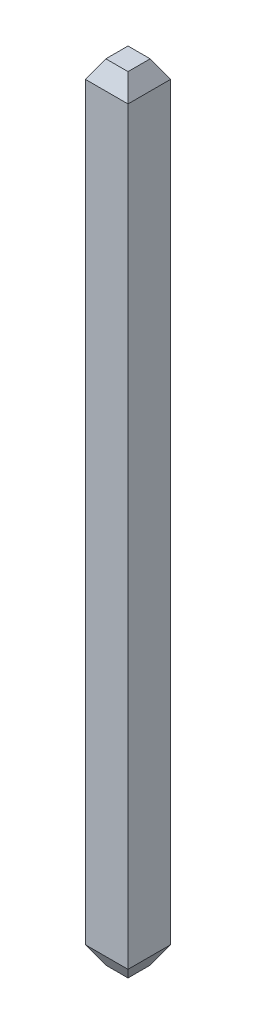
ISO-10303-21;
HEADER;
FILE_DESCRIPTION(('STEP AP214'),'2;1');
FILE_NAME('part.step','',(''),(''),'','','');
FILE_SCHEMA(('AUTOMOTIVE_DESIGN { 1 0 10303 214 1 1 1 1 }'));
ENDSEC;
DATA;
#1=APPLICATION_CONTEXT('core data for automotive mechanical design processes');
#2=APPLICATION_PROTOCOL_DEFINITION('international standard','automotive_design',2000,#1);
#3=PRODUCT_CONTEXT('',#1,'mechanical');
#4=PRODUCT('Part','Part','',(#3));
#5=PRODUCT_RELATED_PRODUCT_CATEGORY('part','',(#4));
#6=PRODUCT_DEFINITION_FORMATION('','',#4);
#7=PRODUCT_DEFINITION_CONTEXT('part definition',#1,'design');
#8=PRODUCT_DEFINITION('design','',#6,#7);
#9=PRODUCT_DEFINITION_SHAPE('','',#8);
#10=(LENGTH_UNIT() NAMED_UNIT(*) SI_UNIT(.MILLI.,.METRE.));
#11=(NAMED_UNIT(*) PLANE_ANGLE_UNIT() SI_UNIT($,.RADIAN.));
#12=(NAMED_UNIT(*) SI_UNIT($,.STERADIAN.) SOLID_ANGLE_UNIT());
#13=UNCERTAINTY_MEASURE_WITH_UNIT(LENGTH_MEASURE(1.E-05),#10,'distance_accuracy_value','');
#14=(GEOMETRIC_REPRESENTATION_CONTEXT(3) GLOBAL_UNCERTAINTY_ASSIGNED_CONTEXT((#13)) GLOBAL_UNIT_ASSIGNED_CONTEXT((#10,
#11,#12)) REPRESENTATION_CONTEXT('',''));
#15=CARTESIAN_POINT('',(0.,0.,0.));
#16=DIRECTION('',(0.,0.,1.));
#17=DIRECTION('',(1.,0.,0.));
#18=AXIS2_PLACEMENT_3D('',#15,#16,#17);
#19=CARTESIAN_POINT('',(4.7625,-5.58,-1.435));
#20=DIRECTION('',(0.,0.50000000000019,0.866025403784329));
#21=DIRECTION('',(1.,0.,0.));
#22=AXIS2_PLACEMENT_3D('',#19,#20,#21);
#23=PLANE('',#22);
#24=DIRECTION('',(-0.44721359550015,0.774596669241261,-0.44721359550015));
#25=VECTOR('',#24,1.);
#26=CARTESIAN_POINT('',(4.915,-5.58,-1.435));
#27=LINE('',#26,#25);
#28=CARTESIAN_POINT('',(4.915,-5.58,-1.435));
#29=VERTEX_POINT('',#28);
#30=CARTESIAN_POINT('',(4.7625,-5.31586225185,-1.5875));
#31=VERTEX_POINT('',#30);
#32=EDGE_CURVE('E142',#29,#31,#27,.T.);
#33=ORIENTED_EDGE('',*,*,#32,.T.);
#34=DIRECTION('',(1.,0.,0.));
#35=VECTOR('',#34,1.);
#36=CARTESIAN_POINT('',(4.7625,-5.31586225185,-1.5875));
#37=LINE('',#36,#35);
#38=CARTESIAN_POINT('',(5.3975,-5.31586225185,-1.5875));
#39=VERTEX_POINT('',#38);
#40=EDGE_CURVE('E19',#31,#39,#37,.T.);
#41=ORIENTED_EDGE('',*,*,#40,.T.);
#42=DIRECTION('',(0.44721359550015,0.774596669241261,-0.44721359550015));
#43=VECTOR('',#42,1.);
#44=CARTESIAN_POINT('',(5.245,-5.58,-1.435));
#45=LINE('',#44,#43);
#46=CARTESIAN_POINT('',(5.245,-5.58,-1.435));
#47=VERTEX_POINT('',#46);
#48=EDGE_CURVE('E25',#47,#39,#45,.T.);
#49=ORIENTED_EDGE('',*,*,#48,.F.);
#50=DIRECTION('',(1.,0.,0.));
#51=VECTOR('',#50,1.);
#52=CARTESIAN_POINT('',(4.915,-5.58,-1.435));
#53=LINE('',#52,#51);
#54=EDGE_CURVE('E196',#29,#47,#53,.T.);
#55=ORIENTED_EDGE('',*,*,#54,.F.);
#56=EDGE_LOOP('',(#33,#41,#49,#55));
#57=FACE_BOUND('',#56,.T.);
#58=ADVANCED_FACE('F16',(#57),#23,.F.);
#59=CARTESIAN_POINT('',(5.3975,-5.58,-1.105));
#60=DIRECTION('',(0.,0.50000000000019,-0.866025403784329));
#61=DIRECTION('',(-1.,0.,0.));
#62=AXIS2_PLACEMENT_3D('',#59,#60,#61);
#63=PLANE('',#62);
#64=DIRECTION('',(0.44721359550015,0.774596669241261,0.44721359550015));
#65=VECTOR('',#64,1.);
#66=CARTESIAN_POINT('',(5.245,-5.58,-1.105));
#67=LINE('',#66,#65);
#68=CARTESIAN_POINT('',(5.245,-5.58,-1.105));
#69=VERTEX_POINT('',#68);
#70=CARTESIAN_POINT('',(5.3975,-5.31586225185,-0.9525));
#71=VERTEX_POINT('',#70);
#72=EDGE_CURVE('E11',#69,#71,#67,.T.);
#73=ORIENTED_EDGE('',*,*,#72,.T.);
#74=DIRECTION('',(-1.,0.,0.));
#75=VECTOR('',#74,1.);
#76=CARTESIAN_POINT('',(5.3975,-5.31586225185,-0.9525));
#77=LINE('',#76,#75);
#78=CARTESIAN_POINT('',(4.7625,-5.31586225185,-0.9525));
#79=VERTEX_POINT('',#78);
#80=EDGE_CURVE('E160',#71,#79,#77,.T.);
#81=ORIENTED_EDGE('',*,*,#80,.T.);
#82=DIRECTION('',(-0.44721359550015,0.774596669241261,0.44721359550015));
#83=VECTOR('',#82,1.);
#84=CARTESIAN_POINT('',(4.915,-5.58,-1.105));
#85=LINE('',#84,#83);
#86=CARTESIAN_POINT('',(4.915,-5.58,-1.105));
#87=VERTEX_POINT('',#86);
#88=EDGE_CURVE('E145',#87,#79,#85,.T.);
#89=ORIENTED_EDGE('',*,*,#88,.F.);
#90=DIRECTION('',(-1.,0.,0.));
#91=VECTOR('',#90,1.);
#92=CARTESIAN_POINT('',(5.245,-5.58,-1.105));
#93=LINE('',#92,#91);
#94=EDGE_CURVE('E189',#69,#87,#93,.T.);
#95=ORIENTED_EDGE('',*,*,#94,.F.);
#96=EDGE_LOOP('',(#73,#81,#89,#95));
#97=FACE_BOUND('',#96,.T.);
#98=ADVANCED_FACE('F251',(#97),#63,.F.);
#99=CARTESIAN_POINT('',(5.245,-5.58,-1.5875));
#100=DIRECTION('',(-0.866025403784329,0.50000000000019,0.));
#101=DIRECTION('',(0.,0.,1.));
#102=AXIS2_PLACEMENT_3D('',#99,#100,#101);
#103=PLANE('',#102);
#104=ORIENTED_EDGE('',*,*,#48,.T.);
#105=DIRECTION('',(0.,0.,1.));
#106=VECTOR('',#105,1.);
#107=CARTESIAN_POINT('',(5.3975,-5.31586225185,-1.5875));
#108=LINE('',#107,#106);
#109=EDGE_CURVE('E159',#39,#71,#108,.T.);
#110=ORIENTED_EDGE('',*,*,#109,.T.);
#111=ORIENTED_EDGE('',*,*,#72,.F.);
#112=DIRECTION('',(0.,0.,1.));
#113=VECTOR('',#112,1.);
#114=CARTESIAN_POINT('',(5.245,-5.58,-1.435));
#115=LINE('',#114,#113);
#116=EDGE_CURVE('E200',#47,#69,#115,.T.);
#117=ORIENTED_EDGE('',*,*,#116,.F.);
#118=EDGE_LOOP('',(#104,#110,#111,#117));
#119=FACE_BOUND('',#118,.T.);
#120=ADVANCED_FACE('F255',(#119),#103,.F.);
#121=CARTESIAN_POINT('',(5.08,-5.58,-1.27));
#122=DIRECTION('',(0.,-1.,0.));
#123=DIRECTION('',(0.,0.,-1.));
#124=AXIS2_PLACEMENT_3D('',#121,#122,#123);
#125=PLANE('',#124);
#126=ORIENTED_EDGE('',*,*,#94,.T.);
#127=DIRECTION('',(0.,0.,-1.));
#128=VECTOR('',#127,1.);
#129=CARTESIAN_POINT('',(4.915,-5.58,-1.105));
#130=LINE('',#129,#128);
#131=EDGE_CURVE('E144',#87,#29,#130,.T.);
#132=ORIENTED_EDGE('',*,*,#131,.T.);
#133=ORIENTED_EDGE('',*,*,#54,.T.);
#134=ORIENTED_EDGE('',*,*,#116,.T.);
#135=EDGE_LOOP('',(#126,#132,#133,#134));
#136=FACE_BOUND('',#135,.T.);
#137=ADVANCED_FACE('F223',(#136),#125,.T.);
#138=CARTESIAN_POINT('',(4.915,-5.58,-0.9525));
#139=DIRECTION('',(0.866025403784329,0.50000000000019,0.));
#140=DIRECTION('',(0.,0.,-1.));
#141=AXIS2_PLACEMENT_3D('',#138,#139,#140);
#142=PLANE('',#141);
#143=ORIENTED_EDGE('',*,*,#88,.T.);
#144=DIRECTION('',(0.,0.,-1.));
#145=VECTOR('',#144,1.);
#146=CARTESIAN_POINT('',(4.7625,-5.31586225185,-0.9525));
#147=LINE('',#146,#145);
#148=EDGE_CURVE('E151',#79,#31,#147,.T.);
#149=ORIENTED_EDGE('',*,*,#148,.T.);
#150=ORIENTED_EDGE('',*,*,#32,.F.);
#151=ORIENTED_EDGE('',*,*,#131,.F.);
#152=EDGE_LOOP('',(#143,#149,#150,#151));
#153=FACE_BOUND('',#152,.T.);
#154=ADVANCED_FACE('F230',(#153),#142,.F.);
#155=CARTESIAN_POINT('',(4.7625,6.1,-0.9525));
#156=DIRECTION('',(-1.,0.,0.));
#157=DIRECTION('',(0.,0.,1.));
#158=AXIS2_PLACEMENT_3D('',#155,#156,#157);
#159=PLANE('',#158);
#160=DIRECTION('',(0.,-1.,0.));
#161=VECTOR('',#160,1.);
#162=CARTESIAN_POINT('',(4.7625,5.835862251846,-1.5875));
#163=LINE('',#162,#161);
#164=CARTESIAN_POINT('',(4.7625,5.835862251846,-1.5875));
#165=VERTEX_POINT('',#164);
#166=EDGE_CURVE('E190',#165,#31,#163,.T.);
#167=ORIENTED_EDGE('',*,*,#166,.T.);
#168=ORIENTED_EDGE('',*,*,#148,.F.);
#169=DIRECTION('',(0.,-1.,0.));
#170=VECTOR('',#169,1.);
#171=CARTESIAN_POINT('',(4.7625,5.835862251846,-0.9525));
#172=LINE('',#171,#170);
#173=CARTESIAN_POINT('',(4.7625,5.835862251846,-0.9525));
#174=VERTEX_POINT('',#173);
#175=EDGE_CURVE('E184',#174,#79,#172,.T.);
#176=ORIENTED_EDGE('',*,*,#175,.F.);
#177=DIRECTION('',(0.,0.,-1.));
#178=VECTOR('',#177,1.);
#179=CARTESIAN_POINT('',(4.7625,5.835862251846,-0.9525));
#180=LINE('',#179,#178);
#181=EDGE_CURVE('E155',#174,#165,#180,.T.);
#182=ORIENTED_EDGE('',*,*,#181,.T.);
#183=EDGE_LOOP('',(#167,#168,#176,#182));
#184=FACE_BOUND('',#183,.T.);
#185=ADVANCED_FACE('F234',(#184),#159,.T.);
#186=CARTESIAN_POINT('',(4.7625,6.1,-1.5875));
#187=DIRECTION('',(0.,0.,-1.));
#188=DIRECTION('',(0.,-1.,0.));
#189=AXIS2_PLACEMENT_3D('',#186,#187,#188);
#190=PLANE('',#189);
#191=DIRECTION('',(0.,-1.,0.));
#192=VECTOR('',#191,1.);
#193=CARTESIAN_POINT('',(5.3975,5.835862251846,-1.5875));
#194=LINE('',#193,#192);
#195=CARTESIAN_POINT('',(5.3975,5.835862251846,-1.5875));
#196=VERTEX_POINT('',#195);
#197=EDGE_CURVE('E204',#196,#39,#194,.T.);
#198=ORIENTED_EDGE('',*,*,#197,.T.);
#199=ORIENTED_EDGE('',*,*,#40,.F.);
#200=ORIENTED_EDGE('',*,*,#166,.F.);
#201=DIRECTION('',(1.,0.,0.));
#202=VECTOR('',#201,1.);
#203=CARTESIAN_POINT('',(4.7625,5.835862251846,-1.5875));
#204=LINE('',#203,#202);
#205=EDGE_CURVE('E164',#165,#196,#204,.T.);
#206=ORIENTED_EDGE('',*,*,#205,.T.);
#207=EDGE_LOOP('',(#198,#199,#200,#206));
#208=FACE_BOUND('',#207,.T.);
#209=ADVANCED_FACE('F235',(#208),#190,.T.);
#210=CARTESIAN_POINT('',(5.3975,6.1,-1.5875));
#211=DIRECTION('',(1.,0.,0.));
#212=DIRECTION('',(0.,1.,0.));
#213=AXIS2_PLACEMENT_3D('',#210,#211,#212);
#214=PLANE('',#213);
#215=DIRECTION('',(0.,-1.,0.));
#216=VECTOR('',#215,1.);
#217=CARTESIAN_POINT('',(5.3975,5.835862251846,-0.9525));
#218=LINE('',#217,#216);
#219=CARTESIAN_POINT('',(5.3975,5.835862251846,-0.9525));
#220=VERTEX_POINT('',#219);
#221=EDGE_CURVE('E156',#220,#71,#218,.T.);
#222=ORIENTED_EDGE('',*,*,#221,.T.);
#223=ORIENTED_EDGE('',*,*,#109,.F.);
#224=ORIENTED_EDGE('',*,*,#197,.F.);
#225=DIRECTION('',(0.,0.,1.));
#226=VECTOR('',#225,1.);
#227=CARTESIAN_POINT('',(5.3975,5.835862251846,-1.5875));
#228=LINE('',#227,#226);
#229=EDGE_CURVE('E116',#196,#220,#228,.T.);
#230=ORIENTED_EDGE('',*,*,#229,.T.);
#231=EDGE_LOOP('',(#222,#223,#224,#230));
#232=FACE_BOUND('',#231,.T.);
#233=ADVANCED_FACE('F237',(#232),#214,.T.);
#234=CARTESIAN_POINT('',(5.3975,6.1,-0.9525));
#235=DIRECTION('',(0.,0.,1.));
#236=DIRECTION('',(1.,0.,0.));
#237=AXIS2_PLACEMENT_3D('',#234,#235,#236);
#238=PLANE('',#237);
#239=ORIENTED_EDGE('',*,*,#175,.T.);
#240=ORIENTED_EDGE('',*,*,#80,.F.);
#241=ORIENTED_EDGE('',*,*,#221,.F.);
#242=DIRECTION('',(-1.,0.,0.));
#243=VECTOR('',#242,1.);
#244=CARTESIAN_POINT('',(5.3975,5.835862251846,-0.9525));
#245=LINE('',#244,#243);
#246=EDGE_CURVE('E111',#220,#174,#245,.T.);
#247=ORIENTED_EDGE('',*,*,#246,.T.);
#248=EDGE_LOOP('',(#239,#240,#241,#247));
#249=FACE_BOUND('',#248,.T.);
#250=ADVANCED_FACE('F244',(#249),#238,.T.);
#251=CARTESIAN_POINT('',(5.3975,6.1,-1.105));
#252=DIRECTION('',(0.,0.50000000000019,0.866025403784329));
#253=DIRECTION('',(1.,0.,0.));
#254=AXIS2_PLACEMENT_3D('',#251,#252,#253);
#255=PLANE('',#254);
#256=DIRECTION('',(-0.44721359550015,-0.774596669241261,0.44721359550015));
#257=VECTOR('',#256,1.);
#258=CARTESIAN_POINT('',(4.915,6.1,-1.105));
#259=LINE('',#258,#257);
#260=CARTESIAN_POINT('',(4.915,6.1,-1.105));
#261=VERTEX_POINT('',#260);
#262=EDGE_CURVE('E152',#261,#174,#259,.T.);
#263=ORIENTED_EDGE('',*,*,#262,.T.);
#264=ORIENTED_EDGE('',*,*,#246,.F.);
#265=DIRECTION('',(0.44721359550015,-0.774596669241261,0.44721359550015));
#266=VECTOR('',#265,1.);
#267=CARTESIAN_POINT('',(5.245,6.1,-1.105));
#268=LINE('',#267,#266);
#269=CARTESIAN_POINT('',(5.245,6.1,-1.105));
#270=VERTEX_POINT('',#269);
#271=EDGE_CURVE('E103',#270,#220,#268,.T.);
#272=ORIENTED_EDGE('',*,*,#271,.F.);
#273=DIRECTION('',(-1.,0.,0.));
#274=VECTOR('',#273,1.);
#275=CARTESIAN_POINT('',(5.245,6.1,-1.105));
#276=LINE('',#275,#274);
#277=EDGE_CURVE('E108',#270,#261,#276,.T.);
#278=ORIENTED_EDGE('',*,*,#277,.T.);
#279=EDGE_LOOP('',(#263,#264,#272,#278));
#280=FACE_BOUND('',#279,.T.);
#281=ADVANCED_FACE('F106',(#280),#255,.T.);
#282=CARTESIAN_POINT('',(4.915,6.1,-0.9525));
#283=DIRECTION('',(-0.866025403784329,0.50000000000019,0.));
#284=DIRECTION('',(0.,0.,1.));
#285=AXIS2_PLACEMENT_3D('',#282,#283,#284);
#286=PLANE('',#285);
#287=DIRECTION('',(-0.44721359550015,-0.774596669241261,-0.44721359550015));
#288=VECTOR('',#287,1.);
#289=CARTESIAN_POINT('',(4.915,6.1,-1.435));
#290=LINE('',#289,#288);
#291=CARTESIAN_POINT('',(4.915,6.1,-1.435));
#292=VERTEX_POINT('',#291);
#293=EDGE_CURVE('E161',#292,#165,#290,.T.);
#294=ORIENTED_EDGE('',*,*,#293,.T.);
#295=ORIENTED_EDGE('',*,*,#181,.F.);
#296=ORIENTED_EDGE('',*,*,#262,.F.);
#297=DIRECTION('',(0.,0.,-1.));
#298=VECTOR('',#297,1.);
#299=CARTESIAN_POINT('',(4.915,6.1,-1.105));
#300=LINE('',#299,#298);
#301=EDGE_CURVE('E130',#261,#292,#300,.T.);
#302=ORIENTED_EDGE('',*,*,#301,.T.);
#303=EDGE_LOOP('',(#294,#295,#296,#302));
#304=FACE_BOUND('',#303,.T.);
#305=ADVANCED_FACE('F304',(#304),#286,.T.);
#306=CARTESIAN_POINT('',(4.7625,6.1,-1.435));
#307=DIRECTION('',(0.,0.50000000000019,-0.866025403784329));
#308=DIRECTION('',(-1.,0.,0.));
#309=AXIS2_PLACEMENT_3D('',#306,#307,#308);
#310=PLANE('',#309);
#311=DIRECTION('',(0.44721359550015,-0.774596669241261,-0.44721359550015));
#312=VECTOR('',#311,1.);
#313=CARTESIAN_POINT('',(5.245,6.1,-1.435));
#314=LINE('',#313,#312);
#315=CARTESIAN_POINT('',(5.245,6.1,-1.435));
#316=VERTEX_POINT('',#315);
#317=EDGE_CURVE('E122',#316,#196,#314,.T.);
#318=ORIENTED_EDGE('',*,*,#317,.T.);
#319=ORIENTED_EDGE('',*,*,#205,.F.);
#320=ORIENTED_EDGE('',*,*,#293,.F.);
#321=DIRECTION('',(1.,0.,0.));
#322=VECTOR('',#321,1.);
#323=CARTESIAN_POINT('',(4.915,6.1,-1.435));
#324=LINE('',#323,#322);
#325=EDGE_CURVE('E137',#292,#316,#324,.T.);
#326=ORIENTED_EDGE('',*,*,#325,.T.);
#327=EDGE_LOOP('',(#318,#319,#320,#326));
#328=FACE_BOUND('',#327,.T.);
#329=ADVANCED_FACE('F299',(#328),#310,.T.);
#330=CARTESIAN_POINT('',(5.245,6.1,-1.5875));
#331=DIRECTION('',(0.866025403784329,0.50000000000019,0.));
#332=DIRECTION('',(0.,0.,-1.));
#333=AXIS2_PLACEMENT_3D('',#330,#331,#332);
#334=PLANE('',#333);
#335=ORIENTED_EDGE('',*,*,#271,.T.);
#336=ORIENTED_EDGE('',*,*,#229,.F.);
#337=ORIENTED_EDGE('',*,*,#317,.F.);
#338=DIRECTION('',(0.,0.,1.));
#339=VECTOR('',#338,1.);
#340=CARTESIAN_POINT('',(5.245,6.1,-1.435));
#341=LINE('',#340,#339);
#342=EDGE_CURVE('E117',#316,#270,#341,.T.);
#343=ORIENTED_EDGE('',*,*,#342,.T.);
#344=EDGE_LOOP('',(#335,#336,#337,#343));
#345=FACE_BOUND('',#344,.T.);
#346=ADVANCED_FACE('F120',(#345),#334,.T.);
#347=CARTESIAN_POINT('',(5.08,6.1,-1.27));
#348=DIRECTION('',(0.,-1.,0.));
#349=DIRECTION('',(0.,0.,-1.));
#350=AXIS2_PLACEMENT_3D('',#347,#348,#349);
#351=PLANE('',#350);
#352=ORIENTED_EDGE('',*,*,#325,.F.);
#353=ORIENTED_EDGE('',*,*,#301,.F.);
#354=ORIENTED_EDGE('',*,*,#277,.F.);
#355=ORIENTED_EDGE('',*,*,#342,.F.);
#356=EDGE_LOOP('',(#352,#353,#354,#355));
#357=FACE_BOUND('',#356,.T.);
#358=ADVANCED_FACE('F128',(#357),#351,.F.);
#359=CLOSED_SHELL('',(#58,#98,#120,#137,#154,#185,#209,#233,#250,#281,#305,#329,#346,#358));
#360=MANIFOLD_SOLID_BREP('B1',#359);
#361=ADVANCED_BREP_SHAPE_REPRESENTATION('',(#18,#360),#14);
#362=SHAPE_DEFINITION_REPRESENTATION(#9,#361);
ENDSEC;
END-ISO-10303-21;
